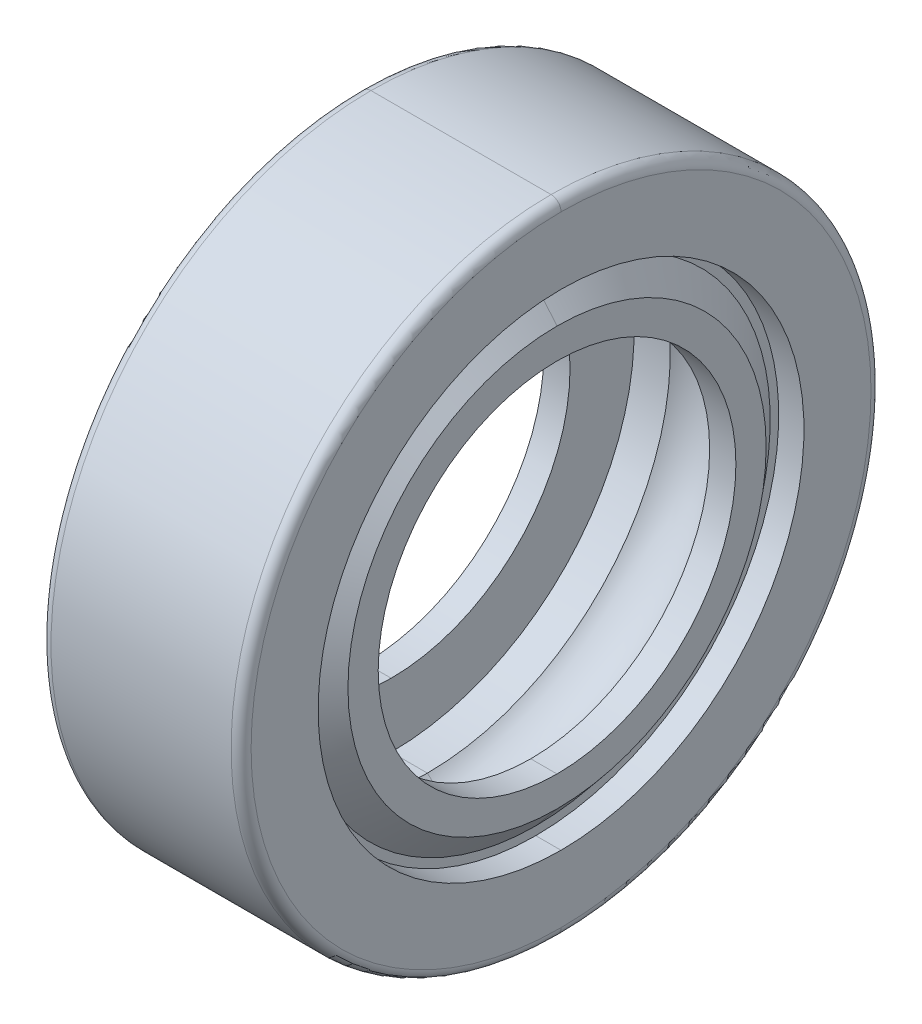
ISO-10303-21;
HEADER;
FILE_DESCRIPTION(('STEP AP214'),'2;1');
FILE_NAME('part.step','',(''),(''),'','','');
FILE_SCHEMA(('AUTOMOTIVE_DESIGN { 1 0 10303 214 1 1 1 1 }'));
ENDSEC;
DATA;
#1=APPLICATION_CONTEXT('core data for automotive mechanical design processes');
#2=APPLICATION_PROTOCOL_DEFINITION('international standard','automotive_design',2000,#1);
#3=PRODUCT_CONTEXT('',#1,'mechanical');
#4=PRODUCT('Part','Part','',(#3));
#5=PRODUCT_RELATED_PRODUCT_CATEGORY('part','',(#4));
#6=PRODUCT_DEFINITION_FORMATION('','',#4);
#7=PRODUCT_DEFINITION_CONTEXT('part definition',#1,'design');
#8=PRODUCT_DEFINITION('design','',#6,#7);
#9=PRODUCT_DEFINITION_SHAPE('','',#8);
#10=(LENGTH_UNIT() NAMED_UNIT(*) SI_UNIT(.MILLI.,.METRE.));
#11=(NAMED_UNIT(*) PLANE_ANGLE_UNIT() SI_UNIT($,.RADIAN.));
#12=(NAMED_UNIT(*) SI_UNIT($,.STERADIAN.) SOLID_ANGLE_UNIT());
#13=UNCERTAINTY_MEASURE_WITH_UNIT(LENGTH_MEASURE(1.E-05),#10,'distance_accuracy_value','');
#14=(GEOMETRIC_REPRESENTATION_CONTEXT(3) GLOBAL_UNCERTAINTY_ASSIGNED_CONTEXT((#13)) GLOBAL_UNIT_ASSIGNED_CONTEXT((#10,
#11,#12)) REPRESENTATION_CONTEXT('',''));
#15=CARTESIAN_POINT('',(0.,0.,0.));
#16=DIRECTION('',(0.,0.,1.));
#17=DIRECTION('',(1.,0.,0.));
#18=AXIS2_PLACEMENT_3D('',#15,#16,#17);
#19=CARTESIAN_POINT('',(-1.87059655427954,0.,0.));
#20=DIRECTION('',(1.,0.,0.));
#21=DIRECTION('',(0.,1.,0.));
#22=AXIS2_PLACEMENT_3D('',#19,#20,#21);
#23=PLANE('',#22);
#24=CARTESIAN_POINT('',(-1.87059655427954,0.,0.));
#25=DIRECTION('',(-1.,0.,0.));
#26=DIRECTION('',(0.,1.,0.));
#27=AXIS2_PLACEMENT_3D('',#24,#25,#26);
#28=CIRCLE('',#27,5.8619649715);
#29=CARTESIAN_POINT('',(-1.87059655427954,5.8619649715,0.));
#30=VERTEX_POINT('',#29);
#31=CARTESIAN_POINT('',(-1.87059655427954,-5.8619649715,0.));
#32=VERTEX_POINT('',#31);
#33=EDGE_CURVE('E358',#30,#32,#28,.T.);
#34=ORIENTED_EDGE('',*,*,#33,.F.);
#35=CARTESIAN_POINT('',(-1.87059655427954,0.,0.));
#36=DIRECTION('',(1.,0.,0.));
#37=DIRECTION('',(0.,1.,0.));
#38=AXIS2_PLACEMENT_3D('',#35,#36,#37);
#39=CIRCLE('',#38,5.8619649715);
#40=EDGE_CURVE('E308',#30,#32,#39,.T.);
#41=ORIENTED_EDGE('',*,*,#40,.T.);
#42=EDGE_LOOP('',(#34,#41));
#43=FACE_BOUND('',#42,.T.);
#44=CARTESIAN_POINT('',(-1.87059655427954,0.,0.));
#45=DIRECTION('',(1.,0.,0.));
#46=DIRECTION('',(0.,-1.,0.));
#47=AXIS2_PLACEMENT_3D('',#44,#45,#46);
#48=CIRCLE('',#47,6.0745751);
#49=CARTESIAN_POINT('',(-1.87059655427954,-6.0745751,0.));
#50=VERTEX_POINT('',#49);
#51=CARTESIAN_POINT('',(-1.87059655427954,6.0745751,0.));
#52=VERTEX_POINT('',#51);
#53=EDGE_CURVE('E28',#50,#52,#48,.T.);
#54=ORIENTED_EDGE('',*,*,#53,.F.);
#55=CARTESIAN_POINT('',(-1.87059655427954,0.,0.));
#56=DIRECTION('',(1.,0.,0.));
#57=DIRECTION('',(0.,1.,0.));
#58=AXIS2_PLACEMENT_3D('',#55,#56,#57);
#59=CIRCLE('',#58,6.0745751);
#60=EDGE_CURVE('E11',#52,#50,#59,.T.);
#61=ORIENTED_EDGE('',*,*,#60,.F.);
#62=EDGE_LOOP('',(#54,#61));
#63=FACE_BOUND('',#62,.T.);
#64=ADVANCED_FACE('F17',(#43,#63),#23,.F.);
#65=CARTESIAN_POINT('',(-2.75209,0.,0.));
#66=DIRECTION('',(1.,0.,0.));
#67=DIRECTION('',(0.,-1.,0.));
#68=AXIS2_PLACEMENT_3D('',#65,#66,#67);
#69=CYLINDRICAL_SURFACE('',#68,6.0745751);
#70=DIRECTION('',(1.,0.,0.));
#71=VECTOR('',#70,1.);
#72=CARTESIAN_POINT('',(-2.5019,-6.0745751,0.));
#73=LINE('',#72,#71);
#74=CARTESIAN_POINT('',(-2.5019,-6.0745751,0.));
#75=VERTEX_POINT('',#74);
#76=EDGE_CURVE('E134',#75,#50,#73,.T.);
#77=ORIENTED_EDGE('',*,*,#76,.F.);
#78=CARTESIAN_POINT('',(-2.5019,0.,0.));
#79=DIRECTION('',(1.,0.,0.));
#80=DIRECTION('',(0.,1.,0.));
#81=AXIS2_PLACEMENT_3D('',#78,#79,#80);
#82=CIRCLE('',#81,6.0745751);
#83=CARTESIAN_POINT('',(-2.5019,6.0745751,0.));
#84=VERTEX_POINT('',#83);
#85=EDGE_CURVE('E349',#84,#75,#82,.T.);
#86=ORIENTED_EDGE('',*,*,#85,.F.);
#87=DIRECTION('',(1.,0.,0.));
#88=VECTOR('',#87,1.);
#89=CARTESIAN_POINT('',(-2.5019,6.0745751,0.));
#90=LINE('',#89,#88);
#91=EDGE_CURVE('E147',#84,#52,#90,.T.);
#92=ORIENTED_EDGE('',*,*,#91,.T.);
#93=ORIENTED_EDGE('',*,*,#60,.T.);
#94=EDGE_LOOP('',(#77,#86,#92,#93));
#95=FACE_BOUND('',#94,.T.);
#96=ADVANCED_FACE('F478',(#95),#69,.F.);
#97=CARTESIAN_POINT('',(-2.75209,0.,0.));
#98=DIRECTION('',(1.,0.,0.));
#99=DIRECTION('',(0.,-1.,0.));
#100=AXIS2_PLACEMENT_3D('',#97,#98,#99);
#101=CYLINDRICAL_SURFACE('',#100,6.0745751);
#102=ORIENTED_EDGE('',*,*,#91,.F.);
#103=CARTESIAN_POINT('',(-2.5019,0.,0.));
#104=DIRECTION('',(-1.,0.,0.));
#105=DIRECTION('',(0.,1.,0.));
#106=AXIS2_PLACEMENT_3D('',#103,#104,#105);
#107=CIRCLE('',#106,6.0745751);
#108=EDGE_CURVE('E262',#84,#75,#107,.T.);
#109=ORIENTED_EDGE('',*,*,#108,.T.);
#110=ORIENTED_EDGE('',*,*,#76,.T.);
#111=ORIENTED_EDGE('',*,*,#53,.T.);
#112=EDGE_LOOP('',(#102,#109,#110,#111));
#113=FACE_BOUND('',#112,.T.);
#114=ADVANCED_FACE('F19',(#113),#101,.F.);
#115=CARTESIAN_POINT('',(-2.5019,0.,0.));
#116=DIRECTION('',(1.,0.,0.));
#117=DIRECTION('',(0.,1.,0.));
#118=AXIS2_PLACEMENT_3D('',#115,#116,#117);
#119=PLANE('',#118);
#120=ORIENTED_EDGE('',*,*,#108,.F.);
#121=ORIENTED_EDGE('',*,*,#85,.T.);
#122=EDGE_LOOP('',(#120,#121));
#123=FACE_BOUND('',#122,.T.);
#124=CARTESIAN_POINT('',(-2.5019,0.,0.));
#125=DIRECTION('',(1.,0.,0.));
#126=DIRECTION('',(0.,1.,0.));
#127=AXIS2_PLACEMENT_3D('',#124,#125,#126);
#128=CIRCLE('',#127,7.75081);
#129=CARTESIAN_POINT('',(-2.5019,7.75081,0.));
#130=VERTEX_POINT('',#129);
#131=CARTESIAN_POINT('',(-2.5019,-7.75081,0.));
#132=VERTEX_POINT('',#131);
#133=EDGE_CURVE('E257',#130,#132,#128,.T.);
#134=ORIENTED_EDGE('',*,*,#133,.F.);
#135=CARTESIAN_POINT('',(-2.5019,0.,0.));
#136=DIRECTION('',(-1.,0.,0.));
#137=DIRECTION('',(0.,1.,0.));
#138=AXIS2_PLACEMENT_3D('',#135,#136,#137);
#139=CIRCLE('',#138,7.75081);
#140=EDGE_CURVE('E259',#130,#132,#139,.T.);
#141=ORIENTED_EDGE('',*,*,#140,.T.);
#142=EDGE_LOOP('',(#134,#141));
#143=FACE_BOUND('',#142,.T.);
#144=ADVANCED_FACE('F563',(#123,#143),#119,.F.);
#145=CARTESIAN_POINT('',(-2.25171,0.,0.));
#146=DIRECTION('',(1.,0.,0.));
#147=DIRECTION('',(0.,-1.,0.));
#148=AXIS2_PLACEMENT_3D('',#145,#146,#147);
#149=TOROIDAL_SURFACE('',#148,7.75081,0.25019);
#150=CARTESIAN_POINT('',(-2.25171,0.,0.));
#151=DIRECTION('',(-1.,0.,0.));
#152=DIRECTION('',(0.,1.,0.));
#153=AXIS2_PLACEMENT_3D('',#150,#151,#152);
#154=CIRCLE('',#153,8.001);
#155=CARTESIAN_POINT('',(-2.25171,8.001,0.));
#156=VERTEX_POINT('',#155);
#157=CARTESIAN_POINT('',(-2.25171,-8.001,0.));
#158=VERTEX_POINT('',#157);
#159=EDGE_CURVE('E292',#156,#158,#154,.T.);
#160=ORIENTED_EDGE('',*,*,#159,.T.);
#161=CARTESIAN_POINT('',(-2.25171,-7.75081,0.));
#162=DIRECTION('',(0.,0.,-1.));
#163=DIRECTION('',(0.,-1.,0.));
#164=AXIS2_PLACEMENT_3D('',#161,#162,#163);
#165=CIRCLE('',#164,0.25019);
#166=EDGE_CURVE('E350',#158,#132,#165,.T.);
#167=ORIENTED_EDGE('',*,*,#166,.T.);
#168=ORIENTED_EDGE('',*,*,#140,.F.);
#169=CARTESIAN_POINT('',(-2.25171,7.75081,0.));
#170=DIRECTION('',(0.,0.,1.));
#171=DIRECTION('',(0.,1.,0.));
#172=AXIS2_PLACEMENT_3D('',#169,#170,#171);
#173=CIRCLE('',#172,0.25019);
#174=EDGE_CURVE('E263',#156,#130,#173,.T.);
#175=ORIENTED_EDGE('',*,*,#174,.F.);
#176=EDGE_LOOP('',(#160,#167,#168,#175));
#177=FACE_BOUND('',#176,.T.);
#178=ADVANCED_FACE('F532',(#177),#149,.T.);
#179=CARTESIAN_POINT('',(-2.25171,0.,0.));
#180=DIRECTION('',(1.,0.,0.));
#181=DIRECTION('',(0.,-1.,0.));
#182=AXIS2_PLACEMENT_3D('',#179,#180,#181);
#183=TOROIDAL_SURFACE('',#182,7.75081,0.25019);
#184=ORIENTED_EDGE('',*,*,#133,.T.);
#185=ORIENTED_EDGE('',*,*,#166,.F.);
#186=CARTESIAN_POINT('',(-2.25171,0.,0.));
#187=DIRECTION('',(1.,0.,0.));
#188=DIRECTION('',(0.,1.,0.));
#189=AXIS2_PLACEMENT_3D('',#186,#187,#188);
#190=CIRCLE('',#189,8.001);
#191=EDGE_CURVE('E253',#156,#158,#190,.T.);
#192=ORIENTED_EDGE('',*,*,#191,.F.);
#193=ORIENTED_EDGE('',*,*,#174,.T.);
#194=EDGE_LOOP('',(#184,#185,#192,#193));
#195=FACE_BOUND('',#194,.T.);
#196=ADVANCED_FACE('F527',(#195),#183,.T.);
#197=CARTESIAN_POINT('',(-2.75209,0.,0.));
#198=DIRECTION('',(1.,0.,0.));
#199=DIRECTION('',(0.,-1.,0.));
#200=AXIS2_PLACEMENT_3D('',#197,#198,#199);
#201=CYLINDRICAL_SURFACE('',#200,8.001);
#202=ORIENTED_EDGE('',*,*,#191,.T.);
#203=DIRECTION('',(-1.,0.,0.));
#204=VECTOR('',#203,1.);
#205=CARTESIAN_POINT('',(2.25171,-8.001,0.));
#206=LINE('',#205,#204);
#207=CARTESIAN_POINT('',(2.25171,-8.001,0.));
#208=VERTEX_POINT('',#207);
#209=EDGE_CURVE('E296',#208,#158,#206,.T.);
#210=ORIENTED_EDGE('',*,*,#209,.F.);
#211=CARTESIAN_POINT('',(2.25171,0.,0.));
#212=DIRECTION('',(1.,0.,0.));
#213=DIRECTION('',(0.,1.,0.));
#214=AXIS2_PLACEMENT_3D('',#211,#212,#213);
#215=CIRCLE('',#214,8.001);
#216=CARTESIAN_POINT('',(2.25171,8.001,0.));
#217=VERTEX_POINT('',#216);
#218=EDGE_CURVE('E275',#217,#208,#215,.T.);
#219=ORIENTED_EDGE('',*,*,#218,.F.);
#220=DIRECTION('',(-1.,0.,0.));
#221=VECTOR('',#220,1.);
#222=CARTESIAN_POINT('',(2.25171,8.001,0.));
#223=LINE('',#222,#221);
#224=EDGE_CURVE('E258',#217,#156,#223,.T.);
#225=ORIENTED_EDGE('',*,*,#224,.T.);
#226=EDGE_LOOP('',(#202,#210,#219,#225));
#227=FACE_BOUND('',#226,.T.);
#228=ADVANCED_FACE('F496',(#227),#201,.T.);
#229=CARTESIAN_POINT('',(-2.75209,0.,0.));
#230=DIRECTION('',(1.,0.,0.));
#231=DIRECTION('',(0.,-1.,0.));
#232=AXIS2_PLACEMENT_3D('',#229,#230,#231);
#233=CYLINDRICAL_SURFACE('',#232,8.001);
#234=CARTESIAN_POINT('',(2.25171,0.,0.));
#235=DIRECTION('',(-1.,0.,0.));
#236=DIRECTION('',(0.,1.,0.));
#237=AXIS2_PLACEMENT_3D('',#234,#235,#236);
#238=CIRCLE('',#237,8.001);
#239=EDGE_CURVE('E316',#217,#208,#238,.T.);
#240=ORIENTED_EDGE('',*,*,#239,.T.);
#241=ORIENTED_EDGE('',*,*,#209,.T.);
#242=ORIENTED_EDGE('',*,*,#159,.F.);
#243=ORIENTED_EDGE('',*,*,#224,.F.);
#244=EDGE_LOOP('',(#240,#241,#242,#243));
#245=FACE_BOUND('',#244,.T.);
#246=ADVANCED_FACE('F492',(#245),#233,.T.);
#247=CARTESIAN_POINT('',(2.25171,0.,0.));
#248=DIRECTION('',(1.,0.,0.));
#249=DIRECTION('',(0.,-1.,0.));
#250=AXIS2_PLACEMENT_3D('',#247,#248,#249);
#251=TOROIDAL_SURFACE('',#250,7.75081,0.25019);
#252=CARTESIAN_POINT('',(2.5019,0.,0.));
#253=DIRECTION('',(-1.,0.,0.));
#254=DIRECTION('',(0.,1.,0.));
#255=AXIS2_PLACEMENT_3D('',#252,#253,#254);
#256=CIRCLE('',#255,7.75081);
#257=CARTESIAN_POINT('',(2.5019,7.75081,0.));
#258=VERTEX_POINT('',#257);
#259=CARTESIAN_POINT('',(2.5019,-7.75081,0.));
#260=VERTEX_POINT('',#259);
#261=EDGE_CURVE('E324',#258,#260,#256,.T.);
#262=ORIENTED_EDGE('',*,*,#261,.T.);
#263=CARTESIAN_POINT('',(2.25171,-7.75081,0.));
#264=DIRECTION('',(0.,0.,-1.));
#265=DIRECTION('',(1.,0.,0.));
#266=AXIS2_PLACEMENT_3D('',#263,#264,#265);
#267=CIRCLE('',#266,0.25019);
#268=EDGE_CURVE('E279',#260,#208,#267,.T.);
#269=ORIENTED_EDGE('',*,*,#268,.T.);
#270=ORIENTED_EDGE('',*,*,#239,.F.);
#271=CARTESIAN_POINT('',(2.25171,7.75081,0.));
#272=DIRECTION('',(0.,0.,1.));
#273=DIRECTION('',(1.,0.,0.));
#274=AXIS2_PLACEMENT_3D('',#271,#272,#273);
#275=CIRCLE('',#274,0.25019);
#276=EDGE_CURVE('E337',#258,#217,#275,.T.);
#277=ORIENTED_EDGE('',*,*,#276,.F.);
#278=EDGE_LOOP('',(#262,#269,#270,#277));
#279=FACE_BOUND('',#278,.T.);
#280=ADVANCED_FACE('F495',(#279),#251,.T.);
#281=CARTESIAN_POINT('',(2.25171,0.,0.));
#282=DIRECTION('',(1.,0.,0.));
#283=DIRECTION('',(0.,-1.,0.));
#284=AXIS2_PLACEMENT_3D('',#281,#282,#283);
#285=TOROIDAL_SURFACE('',#284,7.75081,0.25019);
#286=ORIENTED_EDGE('',*,*,#218,.T.);
#287=ORIENTED_EDGE('',*,*,#268,.F.);
#288=CARTESIAN_POINT('',(2.5019,0.,0.));
#289=DIRECTION('',(1.,0.,0.));
#290=DIRECTION('',(0.,1.,0.));
#291=AXIS2_PLACEMENT_3D('',#288,#289,#290);
#292=CIRCLE('',#291,7.75081);
#293=EDGE_CURVE('E280',#258,#260,#292,.T.);
#294=ORIENTED_EDGE('',*,*,#293,.F.);
#295=ORIENTED_EDGE('',*,*,#276,.T.);
#296=EDGE_LOOP('',(#286,#287,#294,#295));
#297=FACE_BOUND('',#296,.T.);
#298=ADVANCED_FACE('F509',(#297),#285,.T.);
#299=CARTESIAN_POINT('',(2.5019,0.,0.));
#300=DIRECTION('',(1.,0.,0.));
#301=DIRECTION('',(0.,1.,0.));
#302=AXIS2_PLACEMENT_3D('',#299,#300,#301);
#303=PLANE('',#302);
#304=CARTESIAN_POINT('',(2.5019,0.,0.));
#305=DIRECTION('',(1.,0.,0.));
#306=DIRECTION('',(0.,1.,0.));
#307=AXIS2_PLACEMENT_3D('',#304,#305,#306);
#308=CIRCLE('',#307,6.0745751);
#309=CARTESIAN_POINT('',(2.5019,6.0745751,0.));
#310=VERTEX_POINT('',#309);
#311=CARTESIAN_POINT('',(2.5019,-6.0745751,0.));
#312=VERTEX_POINT('',#311);
#313=EDGE_CURVE('E289',#310,#312,#308,.T.);
#314=ORIENTED_EDGE('',*,*,#313,.F.);
#315=CARTESIAN_POINT('',(2.5019,0.,0.));
#316=DIRECTION('',(-1.,0.,0.));
#317=DIRECTION('',(0.,1.,0.));
#318=AXIS2_PLACEMENT_3D('',#315,#316,#317);
#319=CIRCLE('',#318,6.0745751);
#320=EDGE_CURVE('E251',#310,#312,#319,.T.);
#321=ORIENTED_EDGE('',*,*,#320,.T.);
#322=EDGE_LOOP('',(#314,#321));
#323=FACE_BOUND('',#322,.T.);
#324=ORIENTED_EDGE('',*,*,#261,.F.);
#325=ORIENTED_EDGE('',*,*,#293,.T.);
#326=EDGE_LOOP('',(#324,#325));
#327=FACE_BOUND('',#326,.T.);
#328=ADVANCED_FACE('F513',(#323,#327),#303,.T.);
#329=CARTESIAN_POINT('',(-2.75209,0.,0.));
#330=DIRECTION('',(1.,0.,0.));
#331=DIRECTION('',(0.,-1.,0.));
#332=AXIS2_PLACEMENT_3D('',#329,#330,#331);
#333=CYLINDRICAL_SURFACE('',#332,6.0745751);
#334=DIRECTION('',(1.,0.,0.));
#335=VECTOR('',#334,1.);
#336=CARTESIAN_POINT('',(1.87059655427954,-6.0745751,0.));
#337=LINE('',#336,#335);
#338=CARTESIAN_POINT('',(1.87059655427954,-6.0745751,0.));
#339=VERTEX_POINT('',#338);
#340=EDGE_CURVE('E387',#339,#312,#337,.T.);
#341=ORIENTED_EDGE('',*,*,#340,.T.);
#342=ORIENTED_EDGE('',*,*,#320,.F.);
#343=DIRECTION('',(1.,0.,0.));
#344=VECTOR('',#343,1.);
#345=CARTESIAN_POINT('',(1.87059655427954,6.0745751,0.));
#346=LINE('',#345,#344);
#347=CARTESIAN_POINT('',(1.87059655427954,6.0745751,0.));
#348=VERTEX_POINT('',#347);
#349=EDGE_CURVE('E286',#348,#310,#346,.T.);
#350=ORIENTED_EDGE('',*,*,#349,.F.);
#351=CARTESIAN_POINT('',(1.87059655427954,0.,0.));
#352=DIRECTION('',(1.,0.,0.));
#353=DIRECTION('',(0.,-1.,0.));
#354=AXIS2_PLACEMENT_3D('',#351,#352,#353);
#355=CIRCLE('',#354,6.0745751);
#356=EDGE_CURVE('E248',#339,#348,#355,.T.);
#357=ORIENTED_EDGE('',*,*,#356,.F.);
#358=EDGE_LOOP('',(#341,#342,#350,#357));
#359=FACE_BOUND('',#358,.T.);
#360=ADVANCED_FACE('F591',(#359),#333,.F.);
#361=CARTESIAN_POINT('',(1.87059655427954,0.,0.));
#362=DIRECTION('',(1.,0.,0.));
#363=DIRECTION('',(0.,1.,0.));
#364=AXIS2_PLACEMENT_3D('',#361,#362,#363);
#365=PLANE('',#364);
#366=CARTESIAN_POINT('',(1.87059655427954,0.,0.));
#367=DIRECTION('',(1.,0.,0.));
#368=DIRECTION('',(0.,1.,0.));
#369=AXIS2_PLACEMENT_3D('',#366,#367,#368);
#370=CIRCLE('',#369,5.8619649715);
#371=CARTESIAN_POINT('',(1.87059655427954,5.8619649715,0.));
#372=VERTEX_POINT('',#371);
#373=CARTESIAN_POINT('',(1.87059655427954,-5.8619649715,0.));
#374=VERTEX_POINT('',#373);
#375=EDGE_CURVE('E21',#372,#374,#370,.T.);
#376=ORIENTED_EDGE('',*,*,#375,.F.);
#377=CARTESIAN_POINT('',(1.87059655427954,0.,0.));
#378=DIRECTION('',(-1.,0.,0.));
#379=DIRECTION('',(0.,1.,0.));
#380=AXIS2_PLACEMENT_3D('',#377,#378,#379);
#381=CIRCLE('',#380,5.8619649715);
#382=EDGE_CURVE('E290',#372,#374,#381,.T.);
#383=ORIENTED_EDGE('',*,*,#382,.T.);
#384=EDGE_LOOP('',(#376,#383));
#385=FACE_BOUND('',#384,.T.);
#386=ORIENTED_EDGE('',*,*,#356,.T.);
#387=CARTESIAN_POINT('',(1.87059655427954,0.,0.));
#388=DIRECTION('',(1.,0.,0.));
#389=DIRECTION('',(0.,1.,0.));
#390=AXIS2_PLACEMENT_3D('',#387,#388,#389);
#391=CIRCLE('',#390,6.0745751);
#392=EDGE_CURVE('E252',#348,#339,#391,.T.);
#393=ORIENTED_EDGE('',*,*,#392,.T.);
#394=EDGE_LOOP('',(#386,#393));
#395=FACE_BOUND('',#394,.T.);
#396=ADVANCED_FACE('F451',(#385,#395),#365,.T.);
#397=CARTESIAN_POINT('',(-2.75209,0.,0.));
#398=DIRECTION('',(1.,0.,0.));
#399=DIRECTION('',(0.,-1.,0.));
#400=AXIS2_PLACEMENT_3D('',#397,#398,#399);
#401=CYLINDRICAL_SURFACE('',#400,6.0745751);
#402=ORIENTED_EDGE('',*,*,#349,.T.);
#403=ORIENTED_EDGE('',*,*,#313,.T.);
#404=ORIENTED_EDGE('',*,*,#340,.F.);
#405=ORIENTED_EDGE('',*,*,#392,.F.);
#406=EDGE_LOOP('',(#402,#403,#404,#405));
#407=FACE_BOUND('',#406,.T.);
#408=ADVANCED_FACE('F491',(#407),#401,.F.);
#409=CARTESIAN_POINT('',(2.41970134453178,0.,0.));
#410=DIRECTION('',(-1.,0.,0.));
#411=DIRECTION('',(0.,1.,0.));
#412=AXIS2_PLACEMENT_3D('',#409,#410,#411);
#413=CONICAL_SURFACE('',#412,5.20756736500621,0.872664625997165);
#414=CARTESIAN_POINT('',(2.401824,0.,0.));
#415=DIRECTION('',(-1.,0.,0.));
#416=DIRECTION('',(0.,1.,0.));
#417=AXIS2_PLACEMENT_3D('',#414,#415,#416);
#418=CIRCLE('',#417,5.228872754578);
#419=CARTESIAN_POINT('',(2.401824,5.228872754578,0.));
#420=VERTEX_POINT('',#419);
#421=CARTESIAN_POINT('',(2.401824,-5.228872754578,0.));
#422=VERTEX_POINT('',#421);
#423=EDGE_CURVE('E225',#420,#422,#418,.T.);
#424=ORIENTED_EDGE('',*,*,#423,.T.);
#425=DIRECTION('',(-0.642787609686539,-0.766044443118978,0.));
#426=VECTOR('',#425,1.);
#427=CARTESIAN_POINT('',(2.401824,-5.228872754578,0.));
#428=LINE('',#427,#426);
#429=EDGE_CURVE('E318',#422,#374,#428,.T.);
#430=ORIENTED_EDGE('',*,*,#429,.T.);
#431=ORIENTED_EDGE('',*,*,#382,.F.);
#432=DIRECTION('',(-0.642787609686539,0.766044443118978,0.));
#433=VECTOR('',#432,1.);
#434=CARTESIAN_POINT('',(2.401824,5.228872754578,0.));
#435=LINE('',#434,#433);
#436=EDGE_CURVE('E322',#420,#372,#435,.T.);
#437=ORIENTED_EDGE('',*,*,#436,.F.);
#438=EDGE_LOOP('',(#424,#430,#431,#437));
#439=FACE_BOUND('',#438,.T.);
#440=ADVANCED_FACE('F455',(#439),#413,.T.);
#441=CARTESIAN_POINT('',(2.41970134453178,0.,0.));
#442=DIRECTION('',(-1.,0.,0.));
#443=DIRECTION('',(0.,1.,0.));
#444=AXIS2_PLACEMENT_3D('',#441,#442,#443);
#445=CONICAL_SURFACE('',#444,5.20756736500621,0.872664625997165);
#446=ORIENTED_EDGE('',*,*,#375,.T.);
#447=ORIENTED_EDGE('',*,*,#429,.F.);
#448=CARTESIAN_POINT('',(2.401824,0.,0.));
#449=DIRECTION('',(1.,0.,0.));
#450=DIRECTION('',(0.,1.,0.));
#451=AXIS2_PLACEMENT_3D('',#448,#449,#450);
#452=CIRCLE('',#451,5.228872754578);
#453=EDGE_CURVE('E405',#420,#422,#452,.T.);
#454=ORIENTED_EDGE('',*,*,#453,.F.);
#455=ORIENTED_EDGE('',*,*,#436,.T.);
#456=EDGE_LOOP('',(#446,#447,#454,#455));
#457=FACE_BOUND('',#456,.T.);
#458=ADVANCED_FACE('F460',(#457),#445,.T.);
#459=CARTESIAN_POINT('',(2.401824,0.,0.));
#460=DIRECTION('',(1.,0.,0.));
#461=DIRECTION('',(0.,1.,0.));
#462=AXIS2_PLACEMENT_3D('',#459,#460,#461);
#463=PLANE('',#462);
#464=CARTESIAN_POINT('',(2.401824,0.,0.));
#465=DIRECTION('',(1.,0.,0.));
#466=DIRECTION('',(0.,1.,0.));
#467=AXIS2_PLACEMENT_3D('',#464,#465,#466);
#468=CIRCLE('',#467,4.472608149);
#469=CARTESIAN_POINT('',(2.401824,4.472608149,0.));
#470=VERTEX_POINT('',#469);
#471=CARTESIAN_POINT('',(2.401824,-4.472608149,0.));
#472=VERTEX_POINT('',#471);
#473=EDGE_CURVE('E223',#470,#472,#468,.T.);
#474=ORIENTED_EDGE('',*,*,#473,.F.);
#475=CARTESIAN_POINT('',(2.401824,0.,0.));
#476=DIRECTION('',(-1.,0.,0.));
#477=DIRECTION('',(0.,1.,0.));
#478=AXIS2_PLACEMENT_3D('',#475,#476,#477);
#479=CIRCLE('',#478,4.472608149);
#480=EDGE_CURVE('E218',#470,#472,#479,.T.);
#481=ORIENTED_EDGE('',*,*,#480,.T.);
#482=EDGE_LOOP('',(#474,#481));
#483=FACE_BOUND('',#482,.T.);
#484=ORIENTED_EDGE('',*,*,#423,.F.);
#485=ORIENTED_EDGE('',*,*,#453,.T.);
#486=EDGE_LOOP('',(#484,#485));
#487=FACE_BOUND('',#486,.T.);
#488=ADVANCED_FACE('F220',(#483,#487),#463,.T.);
#489=CARTESIAN_POINT('',(-2.6420064,0.,0.));
#490=DIRECTION('',(1.,0.,0.));
#491=DIRECTION('',(0.,-1.,0.));
#492=AXIS2_PLACEMENT_3D('',#489,#490,#491);
#493=CYLINDRICAL_SURFACE('',#492,4.472608149);
#494=CARTESIAN_POINT('',(1.74550155427954,0.,0.));
#495=DIRECTION('',(-1.,0.,0.));
#496=DIRECTION('',(0.,1.,0.));
#497=AXIS2_PLACEMENT_3D('',#494,#495,#496);
#498=CIRCLE('',#497,4.472608149);
#499=CARTESIAN_POINT('',(1.74550155427954,4.472608149,0.));
#500=VERTEX_POINT('',#499);
#501=CARTESIAN_POINT('',(1.74550155427954,-4.472608149,0.));
#502=VERTEX_POINT('',#501);
#503=EDGE_CURVE('E230',#500,#502,#498,.T.);
#504=ORIENTED_EDGE('',*,*,#503,.T.);
#505=DIRECTION('',(1.,0.,0.));
#506=VECTOR('',#505,1.);
#507=CARTESIAN_POINT('',(1.74550155427954,-4.472608149,0.));
#508=LINE('',#507,#506);
#509=EDGE_CURVE('E227',#502,#472,#508,.T.);
#510=ORIENTED_EDGE('',*,*,#509,.T.);
#511=ORIENTED_EDGE('',*,*,#480,.F.);
#512=DIRECTION('',(1.,0.,0.));
#513=VECTOR('',#512,1.);
#514=CARTESIAN_POINT('',(1.74550155427954,4.472608149,0.));
#515=LINE('',#514,#513);
#516=EDGE_CURVE('E104',#500,#470,#515,.T.);
#517=ORIENTED_EDGE('',*,*,#516,.F.);
#518=EDGE_LOOP('',(#504,#510,#511,#517));
#519=FACE_BOUND('',#518,.T.);
#520=ADVANCED_FACE('F228',(#519),#493,.F.);
#521=CARTESIAN_POINT('',(-2.6420064,0.,0.));
#522=DIRECTION('',(1.,0.,0.));
#523=DIRECTION('',(0.,-1.,0.));
#524=AXIS2_PLACEMENT_3D('',#521,#522,#523);
#525=CYLINDRICAL_SURFACE('',#524,4.472608149);
#526=ORIENTED_EDGE('',*,*,#473,.T.);
#527=ORIENTED_EDGE('',*,*,#509,.F.);
#528=CARTESIAN_POINT('',(1.74550155427954,0.,0.));
#529=DIRECTION('',(1.,0.,0.));
#530=DIRECTION('',(0.,1.,0.));
#531=AXIS2_PLACEMENT_3D('',#528,#529,#530);
#532=CIRCLE('',#531,4.472608149);
#533=EDGE_CURVE('E237',#500,#502,#532,.T.);
#534=ORIENTED_EDGE('',*,*,#533,.F.);
#535=ORIENTED_EDGE('',*,*,#516,.T.);
#536=EDGE_LOOP('',(#526,#527,#534,#535));
#537=FACE_BOUND('',#536,.T.);
#538=ADVANCED_FACE('F235',(#537),#525,.F.);
#539=CARTESIAN_POINT('',(1.74550155427954,0.,0.));
#540=DIRECTION('',(1.,0.,0.));
#541=DIRECTION('',(0.,1.,0.));
#542=AXIS2_PLACEMENT_3D('',#539,#540,#541);
#543=PLANE('',#542);
#544=ORIENTED_EDGE('',*,*,#503,.F.);
#545=ORIENTED_EDGE('',*,*,#533,.T.);
#546=EDGE_LOOP('',(#544,#545));
#547=FACE_BOUND('',#546,.T.);
#548=CARTESIAN_POINT('',(1.74550155427955,0.,0.));
#549=DIRECTION('',(1.,0.,0.));
#550=DIRECTION('',(0.,-1.,0.));
#551=AXIS2_PLACEMENT_3D('',#548,#549,#550);
#552=CIRCLE('',#551,6.0745751);
#553=CARTESIAN_POINT('',(1.74550155427954,-6.0745751,0.));
#554=VERTEX_POINT('',#553);
#555=CARTESIAN_POINT('',(1.74550155427954,6.0745751,0.));
#556=VERTEX_POINT('',#555);
#557=EDGE_CURVE('E302',#554,#556,#552,.T.);
#558=ORIENTED_EDGE('',*,*,#557,.F.);
#559=CARTESIAN_POINT('',(1.74550155427955,0.,0.));
#560=DIRECTION('',(1.,0.,0.));
#561=DIRECTION('',(0.,1.,0.));
#562=AXIS2_PLACEMENT_3D('',#559,#560,#561);
#563=CIRCLE('',#562,6.0745751);
#564=EDGE_CURVE('E91',#556,#554,#563,.T.);
#565=ORIENTED_EDGE('',*,*,#564,.F.);
#566=EDGE_LOOP('',(#558,#565));
#567=FACE_BOUND('',#566,.T.);
#568=ADVANCED_FACE('F596',(#547,#567),#543,.F.);
#569=CARTESIAN_POINT('',(-2.75209,0.,0.));
#570=DIRECTION('',(1.,0.,0.));
#571=DIRECTION('',(0.,-1.,0.));
#572=AXIS2_PLACEMENT_3D('',#569,#570,#571);
#573=CYLINDRICAL_SURFACE('',#572,6.0745751);
#574=DIRECTION('',(1.,0.,0.));
#575=VECTOR('',#574,1.);
#576=CARTESIAN_POINT('',(0.839755569912454,-6.0745751,0.));
#577=LINE('',#576,#575);
#578=CARTESIAN_POINT('',(0.839755569912454,-6.0745751,0.));
#579=VERTEX_POINT('',#578);
#580=EDGE_CURVE('E300',#579,#554,#577,.T.);
#581=ORIENTED_EDGE('',*,*,#580,.F.);
#582=CARTESIAN_POINT('',(0.839755569912455,0.,0.));
#583=DIRECTION('',(1.,0.,0.));
#584=DIRECTION('',(0.,1.,0.));
#585=AXIS2_PLACEMENT_3D('',#582,#583,#584);
#586=CIRCLE('',#585,6.0745751);
#587=CARTESIAN_POINT('',(0.839755569912454,6.0745751,0.));
#588=VERTEX_POINT('',#587);
#589=EDGE_CURVE('E281',#588,#579,#586,.T.);
#590=ORIENTED_EDGE('',*,*,#589,.F.);
#591=DIRECTION('',(1.,0.,0.));
#592=VECTOR('',#591,1.);
#593=CARTESIAN_POINT('',(0.839755569912454,6.0745751,0.));
#594=LINE('',#593,#592);
#595=EDGE_CURVE('E297',#588,#556,#594,.T.);
#596=ORIENTED_EDGE('',*,*,#595,.T.);
#597=ORIENTED_EDGE('',*,*,#564,.T.);
#598=EDGE_LOOP('',(#581,#590,#596,#597));
#599=FACE_BOUND('',#598,.T.);
#600=ADVANCED_FACE('F584',(#599),#573,.F.);
#601=CARTESIAN_POINT('',(-2.75209,0.,0.));
#602=DIRECTION('',(1.,0.,0.));
#603=DIRECTION('',(0.,-1.,0.));
#604=AXIS2_PLACEMENT_3D('',#601,#602,#603);
#605=CYLINDRICAL_SURFACE('',#604,6.0745751);
#606=ORIENTED_EDGE('',*,*,#595,.F.);
#607=CARTESIAN_POINT('',(0.839755569912455,0.,0.));
#608=DIRECTION('',(-1.,0.,0.));
#609=DIRECTION('',(0.,1.,0.));
#610=AXIS2_PLACEMENT_3D('',#607,#608,#609);
#611=CIRCLE('',#610,6.0745751);
#612=EDGE_CURVE('E301',#588,#579,#611,.T.);
#613=ORIENTED_EDGE('',*,*,#612,.T.);
#614=ORIENTED_EDGE('',*,*,#580,.T.);
#615=ORIENTED_EDGE('',*,*,#557,.T.);
#616=EDGE_LOOP('',(#606,#613,#614,#615));
#617=FACE_BOUND('',#616,.T.);
#618=ADVANCED_FACE('F577',(#617),#605,.F.);
#619=CARTESIAN_POINT('',(0.,0.,0.));
#620=DIRECTION('',(1.,0.,0.));
#621=DIRECTION('',(0.,-1.,0.));
#622=AXIS2_PLACEMENT_3D('',#619,#620,#621);
#623=TOROIDAL_SURFACE('',#622,5.25145,1.175893);
#624=CARTESIAN_POINT('',(-0.839755569912454,0.,0.));
#625=DIRECTION('',(-1.,0.,0.));
#626=DIRECTION('',(0.,1.,0.));
#627=AXIS2_PLACEMENT_3D('',#624,#625,#626);
#628=CIRCLE('',#627,6.0745751);
#629=CARTESIAN_POINT('',(-0.839755569912454,6.0745751,0.));
#630=VERTEX_POINT('',#629);
#631=CARTESIAN_POINT('',(-0.839755569912454,-6.0745751,0.));
#632=VERTEX_POINT('',#631);
#633=EDGE_CURVE('E330',#630,#632,#628,.T.);
#634=ORIENTED_EDGE('',*,*,#633,.T.);
#635=CARTESIAN_POINT('',(0.,-5.25145,0.));
#636=DIRECTION('',(0.,0.,1.));
#637=DIRECTION('',(-0.714142842854285,-0.7,0.));
#638=AXIS2_PLACEMENT_3D('',#635,#636,#637);
#639=CIRCLE('',#638,1.175893);
#640=EDGE_CURVE('E285',#632,#579,#639,.T.);
#641=ORIENTED_EDGE('',*,*,#640,.T.);
#642=ORIENTED_EDGE('',*,*,#612,.F.);
#643=CARTESIAN_POINT('',(0.,5.25145,0.));
#644=DIRECTION('',(0.,0.,-1.));
#645=DIRECTION('',(-0.714142842854285,0.7,0.));
#646=AXIS2_PLACEMENT_3D('',#643,#644,#645);
#647=CIRCLE('',#646,1.175893);
#648=EDGE_CURVE('E246',#630,#588,#647,.T.);
#649=ORIENTED_EDGE('',*,*,#648,.F.);
#650=EDGE_LOOP('',(#634,#641,#642,#649));
#651=FACE_BOUND('',#650,.T.);
#652=ADVANCED_FACE('F573',(#651),#623,.F.);
#653=CARTESIAN_POINT('',(0.,0.,0.));
#654=DIRECTION('',(1.,0.,0.));
#655=DIRECTION('',(0.,-1.,0.));
#656=AXIS2_PLACEMENT_3D('',#653,#654,#655);
#657=TOROIDAL_SURFACE('',#656,5.25145,1.175893);
#658=ORIENTED_EDGE('',*,*,#589,.T.);
#659=ORIENTED_EDGE('',*,*,#640,.F.);
#660=CARTESIAN_POINT('',(-0.839755569912454,0.,0.));
#661=DIRECTION('',(1.,0.,0.));
#662=DIRECTION('',(0.,1.,0.));
#663=AXIS2_PLACEMENT_3D('',#660,#661,#662);
#664=CIRCLE('',#663,6.0745751);
#665=EDGE_CURVE('E273',#630,#632,#664,.T.);
#666=ORIENTED_EDGE('',*,*,#665,.F.);
#667=ORIENTED_EDGE('',*,*,#648,.T.);
#668=EDGE_LOOP('',(#658,#659,#666,#667));
#669=FACE_BOUND('',#668,.T.);
#670=ADVANCED_FACE('F576',(#669),#657,.F.);
#671=CARTESIAN_POINT('',(-2.75209,0.,0.));
#672=DIRECTION('',(1.,0.,0.));
#673=DIRECTION('',(0.,-1.,0.));
#674=AXIS2_PLACEMENT_3D('',#671,#672,#673);
#675=CYLINDRICAL_SURFACE('',#674,6.0745751);
#676=DIRECTION('',(1.,0.,0.));
#677=VECTOR('',#676,1.);
#678=CARTESIAN_POINT('',(-1.74550155427954,6.0745751,0.));
#679=LINE('',#678,#677);
#680=CARTESIAN_POINT('',(-1.74550155427954,6.0745751,0.));
#681=VERTEX_POINT('',#680);
#682=EDGE_CURVE('E326',#681,#630,#679,.T.);
#683=ORIENTED_EDGE('',*,*,#682,.T.);
#684=ORIENTED_EDGE('',*,*,#665,.T.);
#685=DIRECTION('',(1.,0.,0.));
#686=VECTOR('',#685,1.);
#687=CARTESIAN_POINT('',(-1.74550155427954,-6.0745751,0.));
#688=LINE('',#687,#686);
#689=CARTESIAN_POINT('',(-1.74550155427954,-6.0745751,0.));
#690=VERTEX_POINT('',#689);
#691=EDGE_CURVE('E433',#690,#632,#688,.T.);
#692=ORIENTED_EDGE('',*,*,#691,.F.);
#693=CARTESIAN_POINT('',(-1.74550155427954,0.,0.));
#694=DIRECTION('',(1.,0.,0.));
#695=DIRECTION('',(0.,1.,0.));
#696=AXIS2_PLACEMENT_3D('',#693,#694,#695);
#697=CIRCLE('',#696,6.0745751);
#698=EDGE_CURVE('E270',#681,#690,#697,.T.);
#699=ORIENTED_EDGE('',*,*,#698,.F.);
#700=EDGE_LOOP('',(#683,#684,#692,#699));
#701=FACE_BOUND('',#700,.T.);
#702=ADVANCED_FACE('F487',(#701),#675,.F.);
#703=CARTESIAN_POINT('',(-1.74550155427954,0.,0.));
#704=DIRECTION('',(1.,0.,0.));
#705=DIRECTION('',(0.,1.,0.));
#706=AXIS2_PLACEMENT_3D('',#703,#704,#705);
#707=PLANE('',#706);
#708=CARTESIAN_POINT('',(-1.74550155427954,0.,0.));
#709=DIRECTION('',(1.,0.,0.));
#710=DIRECTION('',(0.,1.,0.));
#711=AXIS2_PLACEMENT_3D('',#708,#709,#710);
#712=CIRCLE('',#711,4.472608149);
#713=CARTESIAN_POINT('',(-1.74550155427954,4.472608149,0.));
#714=VERTEX_POINT('',#713);
#715=CARTESIAN_POINT('',(-1.74550155427954,-4.472608149,0.));
#716=VERTEX_POINT('',#715);
#717=EDGE_CURVE('E264',#714,#716,#712,.T.);
#718=ORIENTED_EDGE('',*,*,#717,.F.);
#719=CARTESIAN_POINT('',(-1.74550155427954,0.,0.));
#720=DIRECTION('',(-1.,0.,0.));
#721=DIRECTION('',(0.,1.,0.));
#722=AXIS2_PLACEMENT_3D('',#719,#720,#721);
#723=CIRCLE('',#722,4.472608149);
#724=EDGE_CURVE('E430',#714,#716,#723,.T.);
#725=ORIENTED_EDGE('',*,*,#724,.T.);
#726=EDGE_LOOP('',(#718,#725));
#727=FACE_BOUND('',#726,.T.);
#728=CARTESIAN_POINT('',(-1.74550155427954,0.,0.));
#729=DIRECTION('',(1.,0.,0.));
#730=DIRECTION('',(0.,-1.,0.));
#731=AXIS2_PLACEMENT_3D('',#728,#729,#730);
#732=CIRCLE('',#731,6.0745751);
#733=EDGE_CURVE('E274',#690,#681,#732,.T.);
#734=ORIENTED_EDGE('',*,*,#733,.T.);
#735=ORIENTED_EDGE('',*,*,#698,.T.);
#736=EDGE_LOOP('',(#734,#735));
#737=FACE_BOUND('',#736,.T.);
#738=ADVANCED_FACE('F519',(#727,#737),#707,.T.);
#739=CARTESIAN_POINT('',(-2.75209,0.,0.));
#740=DIRECTION('',(1.,0.,0.));
#741=DIRECTION('',(0.,-1.,0.));
#742=AXIS2_PLACEMENT_3D('',#739,#740,#741);
#743=CYLINDRICAL_SURFACE('',#742,6.0745751);
#744=ORIENTED_EDGE('',*,*,#691,.T.);
#745=ORIENTED_EDGE('',*,*,#633,.F.);
#746=ORIENTED_EDGE('',*,*,#682,.F.);
#747=ORIENTED_EDGE('',*,*,#733,.F.);
#748=EDGE_LOOP('',(#744,#745,#746,#747));
#749=FACE_BOUND('',#748,.T.);
#750=ADVANCED_FACE('F501',(#749),#743,.F.);
#751=CARTESIAN_POINT('',(-2.6420064,0.,0.));
#752=DIRECTION('',(1.,0.,0.));
#753=DIRECTION('',(0.,-1.,0.));
#754=AXIS2_PLACEMENT_3D('',#751,#752,#753);
#755=CYLINDRICAL_SURFACE('',#754,4.472608149);
#756=CARTESIAN_POINT('',(-2.401824,0.,0.));
#757=DIRECTION('',(-1.,0.,0.));
#758=DIRECTION('',(0.,1.,0.));
#759=AXIS2_PLACEMENT_3D('',#756,#757,#758);
#760=CIRCLE('',#759,4.472608149);
#761=CARTESIAN_POINT('',(-2.401824,4.472608149,0.));
#762=VERTEX_POINT('',#761);
#763=CARTESIAN_POINT('',(-2.401824,-4.472608149,0.));
#764=VERTEX_POINT('',#763);
#765=EDGE_CURVE('E357',#762,#764,#760,.T.);
#766=ORIENTED_EDGE('',*,*,#765,.T.);
#767=DIRECTION('',(1.,0.,0.));
#768=VECTOR('',#767,1.);
#769=CARTESIAN_POINT('',(-2.401824,-4.472608149,0.));
#770=LINE('',#769,#768);
#771=EDGE_CURVE('E268',#764,#716,#770,.T.);
#772=ORIENTED_EDGE('',*,*,#771,.T.);
#773=ORIENTED_EDGE('',*,*,#724,.F.);
#774=DIRECTION('',(1.,0.,0.));
#775=VECTOR('',#774,1.);
#776=CARTESIAN_POINT('',(-2.401824,4.472608149,0.));
#777=LINE('',#776,#775);
#778=EDGE_CURVE('E434',#762,#714,#777,.T.);
#779=ORIENTED_EDGE('',*,*,#778,.F.);
#780=EDGE_LOOP('',(#766,#772,#773,#779));
#781=FACE_BOUND('',#780,.T.);
#782=ADVANCED_FACE('F498',(#781),#755,.F.);
#783=CARTESIAN_POINT('',(-2.6420064,0.,0.));
#784=DIRECTION('',(1.,0.,0.));
#785=DIRECTION('',(0.,-1.,0.));
#786=AXIS2_PLACEMENT_3D('',#783,#784,#785);
#787=CYLINDRICAL_SURFACE('',#786,4.472608149);
#788=ORIENTED_EDGE('',*,*,#717,.T.);
#789=ORIENTED_EDGE('',*,*,#771,.F.);
#790=CARTESIAN_POINT('',(-2.401824,0.,0.));
#791=DIRECTION('',(1.,0.,0.));
#792=DIRECTION('',(0.,1.,0.));
#793=AXIS2_PLACEMENT_3D('',#790,#791,#792);
#794=CIRCLE('',#793,4.472608149);
#795=EDGE_CURVE('E269',#762,#764,#794,.T.);
#796=ORIENTED_EDGE('',*,*,#795,.F.);
#797=ORIENTED_EDGE('',*,*,#778,.T.);
#798=EDGE_LOOP('',(#788,#789,#796,#797));
#799=FACE_BOUND('',#798,.T.);
#800=ADVANCED_FACE('F500',(#799),#787,.F.);
#801=CARTESIAN_POINT('',(-2.401824,0.,0.));
#802=DIRECTION('',(1.,0.,0.));
#803=DIRECTION('',(0.,1.,0.));
#804=AXIS2_PLACEMENT_3D('',#801,#802,#803);
#805=PLANE('',#804);
#806=ORIENTED_EDGE('',*,*,#765,.F.);
#807=ORIENTED_EDGE('',*,*,#795,.T.);
#808=EDGE_LOOP('',(#806,#807));
#809=FACE_BOUND('',#808,.T.);
#810=CARTESIAN_POINT('',(-2.401824,0.,0.));
#811=DIRECTION('',(1.,0.,0.));
#812=DIRECTION('',(0.,1.,0.));
#813=AXIS2_PLACEMENT_3D('',#810,#811,#812);
#814=CIRCLE('',#813,5.228872754578);
#815=CARTESIAN_POINT('',(-2.401824,5.228872754578,0.));
#816=VERTEX_POINT('',#815);
#817=CARTESIAN_POINT('',(-2.401824,-5.228872754578,0.));
#818=VERTEX_POINT('',#817);
#819=EDGE_CURVE('E440',#816,#818,#814,.T.);
#820=ORIENTED_EDGE('',*,*,#819,.F.);
#821=CARTESIAN_POINT('',(-2.401824,0.,0.));
#822=DIRECTION('',(-1.,0.,0.));
#823=DIRECTION('',(0.,1.,0.));
#824=AXIS2_PLACEMENT_3D('',#821,#822,#823);
#825=CIRCLE('',#824,5.228872754578);
#826=EDGE_CURVE('E354',#816,#818,#825,.T.);
#827=ORIENTED_EDGE('',*,*,#826,.T.);
#828=EDGE_LOOP('',(#820,#827));
#829=FACE_BOUND('',#828,.T.);
#830=ADVANCED_FACE('F517',(#809,#829),#805,.F.);
#831=CARTESIAN_POINT('',(-2.41970134453178,0.,0.));
#832=DIRECTION('',(1.,0.,0.));
#833=DIRECTION('',(0.,-1.,0.));
#834=AXIS2_PLACEMENT_3D('',#831,#832,#833);
#835=CONICAL_SURFACE('',#834,5.20756736500621,0.872664625997165);
#836=ORIENTED_EDGE('',*,*,#33,.T.);
#837=DIRECTION('',(-0.642787609686539,0.766044443118978,0.));
#838=VECTOR('',#837,1.);
#839=CARTESIAN_POINT('',(-1.87059655427954,-5.8619649715,0.));
#840=LINE('',#839,#838);
#841=EDGE_CURVE('E313',#32,#818,#840,.T.);
#842=ORIENTED_EDGE('',*,*,#841,.T.);
#843=ORIENTED_EDGE('',*,*,#826,.F.);
#844=DIRECTION('',(-0.642787609686539,-0.766044443118978,0.));
#845=VECTOR('',#844,1.);
#846=CARTESIAN_POINT('',(-1.87059655427954,5.8619649715,0.));
#847=LINE('',#846,#845);
#848=EDGE_CURVE('E312',#30,#816,#847,.T.);
#849=ORIENTED_EDGE('',*,*,#848,.F.);
#850=EDGE_LOOP('',(#836,#842,#843,#849));
#851=FACE_BOUND('',#850,.T.);
#852=ADVANCED_FACE('F524',(#851),#835,.T.);
#853=CARTESIAN_POINT('',(-2.41970134453178,0.,0.));
#854=DIRECTION('',(1.,0.,0.));
#855=DIRECTION('',(0.,-1.,0.));
#856=AXIS2_PLACEMENT_3D('',#853,#854,#855);
#857=CONICAL_SURFACE('',#856,5.20756736500621,0.872664625997165);
#858=ORIENTED_EDGE('',*,*,#819,.T.);
#859=ORIENTED_EDGE('',*,*,#841,.F.);
#860=ORIENTED_EDGE('',*,*,#40,.F.);
#861=ORIENTED_EDGE('',*,*,#848,.T.);
#862=EDGE_LOOP('',(#858,#859,#860,#861));
#863=FACE_BOUND('',#862,.T.);
#864=ADVANCED_FACE('F598',(#863),#857,.T.);
#865=CLOSED_SHELL('',(#64,#96,#114,#144,#178,#196,#228,#246,#280,#298,#328,#360,#396,#408,#440,
#458,#488,#520,#538,#568,#600,#618,#652,#670,#702,#738,#750,#782,#800,#830,#852,#864));
#866=MANIFOLD_SOLID_BREP('B1',#865);
#867=ADVANCED_BREP_SHAPE_REPRESENTATION('',(#18,#866),#14);
#868=SHAPE_DEFINITION_REPRESENTATION(#9,#867);
ENDSEC;
END-ISO-10303-21;
